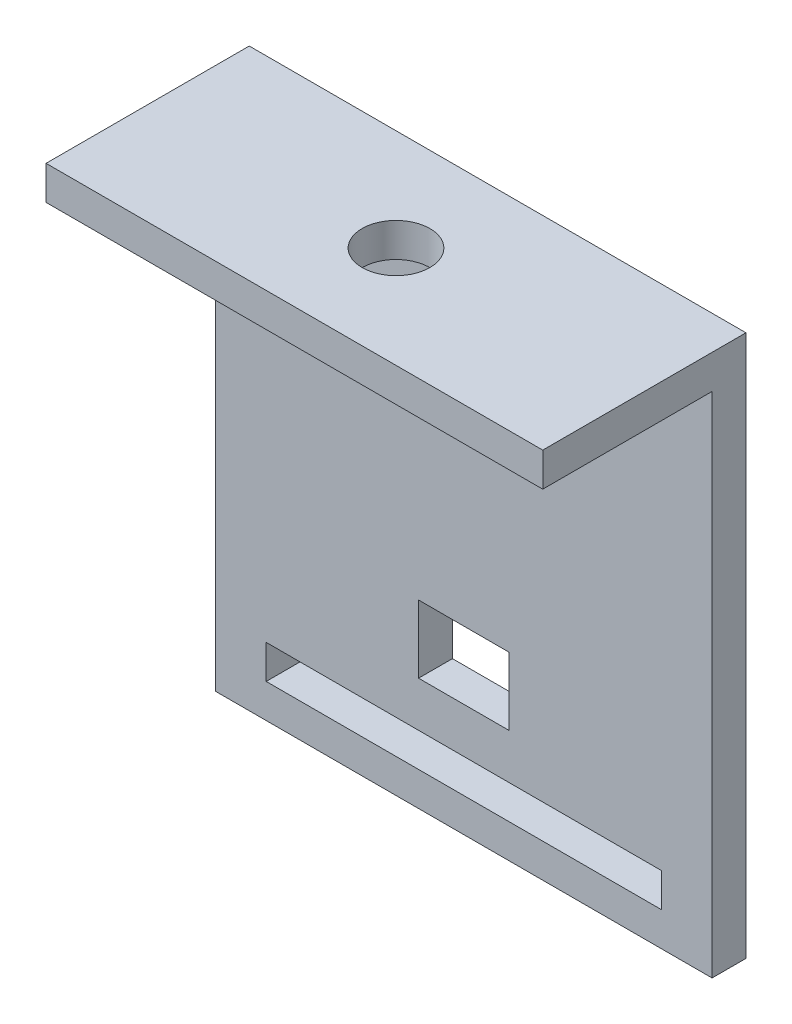
ISO-10303-21;
HEADER;
FILE_DESCRIPTION(('STEP AP214'),'2;1');
FILE_NAME('part.step','',(''),(''),'','','');
FILE_SCHEMA(('AUTOMOTIVE_DESIGN { 1 0 10303 214 1 1 1 1 }'));
ENDSEC;
DATA;
#1=APPLICATION_CONTEXT('core data for automotive mechanical design processes');
#2=APPLICATION_PROTOCOL_DEFINITION('international standard','automotive_design',2000,#1);
#3=PRODUCT_CONTEXT('',#1,'mechanical');
#4=PRODUCT('Part','Part','',(#3));
#5=PRODUCT_RELATED_PRODUCT_CATEGORY('part','',(#4));
#6=PRODUCT_DEFINITION_FORMATION('','',#4);
#7=PRODUCT_DEFINITION_CONTEXT('part definition',#1,'design');
#8=PRODUCT_DEFINITION('design','',#6,#7);
#9=PRODUCT_DEFINITION_SHAPE('','',#8);
#10=(LENGTH_UNIT() NAMED_UNIT(*) SI_UNIT(.MILLI.,.METRE.));
#11=(NAMED_UNIT(*) PLANE_ANGLE_UNIT() SI_UNIT($,.RADIAN.));
#12=(NAMED_UNIT(*) SI_UNIT($,.STERADIAN.) SOLID_ANGLE_UNIT());
#13=UNCERTAINTY_MEASURE_WITH_UNIT(LENGTH_MEASURE(1.E-05),#10,'distance_accuracy_value','');
#14=(GEOMETRIC_REPRESENTATION_CONTEXT(3) GLOBAL_UNCERTAINTY_ASSIGNED_CONTEXT((#13)) GLOBAL_UNIT_ASSIGNED_CONTEXT((#10,
#11,#12)) REPRESENTATION_CONTEXT('',''));
#15=CARTESIAN_POINT('',(0.,0.,0.));
#16=DIRECTION('',(0.,0.,1.));
#17=DIRECTION('',(1.,0.,0.));
#18=AXIS2_PLACEMENT_3D('',#15,#16,#17);
#19=CARTESIAN_POINT('',(44.,0.,-15.));
#20=DIRECTION('',(0.,1.,0.));
#21=DIRECTION('',(0.,0.,1.));
#22=AXIS2_PLACEMENT_3D('',#19,#20,#21);
#23=PLANE('',#22);
#24=CARTESIAN_POINT('',(22.,0.,-9.));
#25=DIRECTION('',(0.,1.,0.));
#26=DIRECTION('',(0.,0.,1.));
#27=AXIS2_PLACEMENT_3D('',#24,#25,#26);
#28=CIRCLE('',#27,3.);
#29=CARTESIAN_POINT('',(22.,0.,-6.));
#30=VERTEX_POINT('',#29);
#31=EDGE_CURVE('E173',#30,#30,#28,.T.);
#32=ORIENTED_EDGE('',*,*,#31,.T.);
#33=EDGE_LOOP('',(#32));
#34=FACE_BOUND('',#33,.T.);
#35=DIRECTION('',(0.,0.,-1.));
#36=VECTOR('',#35,1.);
#37=CARTESIAN_POINT('',(0.,0.,-15.));
#38=LINE('',#37,#36);
#39=CARTESIAN_POINT('',(0.,0.,0.));
#40=VERTEX_POINT('',#39);
#41=CARTESIAN_POINT('',(0.,0.,-15.));
#42=VERTEX_POINT('',#41);
#43=EDGE_CURVE('E190',#40,#42,#38,.T.);
#44=ORIENTED_EDGE('',*,*,#43,.T.);
#45=DIRECTION('',(-1.,0.,0.));
#46=VECTOR('',#45,1.);
#47=CARTESIAN_POINT('',(44.,0.,-15.));
#48=LINE('',#47,#46);
#49=CARTESIAN_POINT('',(44.,0.,-15.));
#50=VERTEX_POINT('',#49);
#51=EDGE_CURVE('E237',#50,#42,#48,.T.);
#52=ORIENTED_EDGE('',*,*,#51,.F.);
#53=DIRECTION('',(0.,0.,-1.));
#54=VECTOR('',#53,1.);
#55=CARTESIAN_POINT('',(44.,0.,-15.));
#56=LINE('',#55,#54);
#57=CARTESIAN_POINT('',(44.,0.,0.));
#58=VERTEX_POINT('',#57);
#59=EDGE_CURVE('E197',#58,#50,#56,.T.);
#60=ORIENTED_EDGE('',*,*,#59,.F.);
#61=DIRECTION('',(-1.,0.,0.));
#62=VECTOR('',#61,1.);
#63=CARTESIAN_POINT('',(44.,0.,0.));
#64=LINE('',#63,#62);
#65=EDGE_CURVE('E211',#58,#40,#64,.T.);
#66=ORIENTED_EDGE('',*,*,#65,.T.);
#67=EDGE_LOOP('',(#44,#52,#60,#66));
#68=FACE_BOUND('',#67,.T.);
#69=ADVANCED_FACE('F33',(#34,#68),#23,.F.);
#70=CARTESIAN_POINT('',(44.,-45.,-15.));
#71=DIRECTION('',(0.,0.,-1.));
#72=DIRECTION('',(0.,1.,0.));
#73=AXIS2_PLACEMENT_3D('',#70,#71,#72);
#74=PLANE('',#73);
#75=DIRECTION('',(-1.,0.,0.));
#76=VECTOR('',#75,1.);
#77=CARTESIAN_POINT('',(44.,-35.,-15.));
#78=LINE('',#77,#76);
#79=CARTESIAN_POINT('',(26.,-35.,-15.));
#80=VERTEX_POINT('',#79);
#81=CARTESIAN_POINT('',(18.,-35.,-15.));
#82=VERTEX_POINT('',#81);
#83=EDGE_CURVE('E164',#80,#82,#78,.T.);
#84=ORIENTED_EDGE('',*,*,#83,.T.);
#85=DIRECTION('',(0.,1.,0.));
#86=VECTOR('',#85,1.);
#87=CARTESIAN_POINT('',(18.,-45.,-15.));
#88=LINE('',#87,#86);
#89=CARTESIAN_POINT('',(18.,-29.,-15.));
#90=VERTEX_POINT('',#89);
#91=EDGE_CURVE('E167',#82,#90,#88,.T.);
#92=ORIENTED_EDGE('',*,*,#91,.T.);
#93=DIRECTION('',(1.,0.,0.));
#94=VECTOR('',#93,1.);
#95=CARTESIAN_POINT('',(44.,-29.,-15.));
#96=LINE('',#95,#94);
#97=CARTESIAN_POINT('',(26.,-29.,-15.));
#98=VERTEX_POINT('',#97);
#99=EDGE_CURVE('E159',#90,#98,#96,.T.);
#100=ORIENTED_EDGE('',*,*,#99,.T.);
#101=DIRECTION('',(0.,-1.,0.));
#102=VECTOR('',#101,1.);
#103=CARTESIAN_POINT('',(26.,-45.,-15.));
#104=LINE('',#103,#102);
#105=EDGE_CURVE('E139',#98,#80,#104,.T.);
#106=ORIENTED_EDGE('',*,*,#105,.T.);
#107=EDGE_LOOP('',(#84,#92,#100,#106));
#108=FACE_BOUND('',#107,.T.);
#109=DIRECTION('',(1.,0.,0.));
#110=VECTOR('',#109,1.);
#111=CARTESIAN_POINT('',(4.5,-42.,-15.));
#112=LINE('',#111,#110);
#113=CARTESIAN_POINT('',(4.5,-42.,-15.));
#114=VERTEX_POINT('',#113);
#115=CARTESIAN_POINT('',(39.5,-42.,-15.));
#116=VERTEX_POINT('',#115);
#117=EDGE_CURVE('E178',#114,#116,#112,.T.);
#118=ORIENTED_EDGE('',*,*,#117,.F.);
#119=DIRECTION('',(0.,-1.,0.));
#120=VECTOR('',#119,1.);
#121=CARTESIAN_POINT('',(4.5,-42.,-15.));
#122=LINE('',#121,#120);
#123=CARTESIAN_POINT('',(4.5,-39.,-15.));
#124=VERTEX_POINT('',#123);
#125=EDGE_CURVE('E176',#124,#114,#122,.T.);
#126=ORIENTED_EDGE('',*,*,#125,.F.);
#127=DIRECTION('',(-1.,0.,0.));
#128=VECTOR('',#127,1.);
#129=CARTESIAN_POINT('',(4.5,-39.,-15.));
#130=LINE('',#129,#128);
#131=CARTESIAN_POINT('',(39.5,-39.,-15.));
#132=VERTEX_POINT('',#131);
#133=EDGE_CURVE('E184',#132,#124,#130,.T.);
#134=ORIENTED_EDGE('',*,*,#133,.F.);
#135=DIRECTION('',(0.,1.,0.));
#136=VECTOR('',#135,1.);
#137=CARTESIAN_POINT('',(39.5,-42.,-15.));
#138=LINE('',#137,#136);
#139=EDGE_CURVE('E181',#116,#132,#138,.T.);
#140=ORIENTED_EDGE('',*,*,#139,.F.);
#141=EDGE_LOOP('',(#118,#126,#134,#140));
#142=FACE_BOUND('',#141,.T.);
#143=DIRECTION('',(0.,-1.,0.));
#144=VECTOR('',#143,1.);
#145=CARTESIAN_POINT('',(0.,-45.,-15.));
#146=LINE('',#145,#144);
#147=CARTESIAN_POINT('',(0.,-45.,-15.));
#148=VERTEX_POINT('',#147);
#149=EDGE_CURVE('E214',#42,#148,#146,.T.);
#150=ORIENTED_EDGE('',*,*,#149,.T.);
#151=DIRECTION('',(-1.,0.,0.));
#152=VECTOR('',#151,1.);
#153=CARTESIAN_POINT('',(44.,-45.,-15.));
#154=LINE('',#153,#152);
#155=CARTESIAN_POINT('',(44.,-45.,-15.));
#156=VERTEX_POINT('',#155);
#157=EDGE_CURVE('E234',#156,#148,#154,.T.);
#158=ORIENTED_EDGE('',*,*,#157,.F.);
#159=DIRECTION('',(0.,-1.,0.));
#160=VECTOR('',#159,1.);
#161=CARTESIAN_POINT('',(44.,-45.,-15.));
#162=LINE('',#161,#160);
#163=EDGE_CURVE('E200',#50,#156,#162,.T.);
#164=ORIENTED_EDGE('',*,*,#163,.F.);
#165=ORIENTED_EDGE('',*,*,#51,.T.);
#166=EDGE_LOOP('',(#150,#158,#164,#165));
#167=FACE_BOUND('',#166,.T.);
#168=ADVANCED_FACE('F259',(#108,#142,#167),#74,.F.);
#169=CARTESIAN_POINT('',(44.,-45.,-18.));
#170=DIRECTION('',(0.,1.,0.));
#171=DIRECTION('',(0.,0.,1.));
#172=AXIS2_PLACEMENT_3D('',#169,#170,#171);
#173=PLANE('',#172);
#174=DIRECTION('',(0.,0.,-1.));
#175=VECTOR('',#174,1.);
#176=CARTESIAN_POINT('',(0.,-45.,-18.));
#177=LINE('',#176,#175);
#178=CARTESIAN_POINT('',(0.,-45.,-18.));
#179=VERTEX_POINT('',#178);
#180=EDGE_CURVE('E216',#148,#179,#177,.T.);
#181=ORIENTED_EDGE('',*,*,#180,.T.);
#182=DIRECTION('',(-1.,0.,0.));
#183=VECTOR('',#182,1.);
#184=CARTESIAN_POINT('',(44.,-45.,-18.));
#185=LINE('',#184,#183);
#186=CARTESIAN_POINT('',(44.,-45.,-18.));
#187=VERTEX_POINT('',#186);
#188=EDGE_CURVE('E231',#187,#179,#185,.T.);
#189=ORIENTED_EDGE('',*,*,#188,.F.);
#190=DIRECTION('',(0.,0.,-1.));
#191=VECTOR('',#190,1.);
#192=CARTESIAN_POINT('',(44.,-45.,-18.));
#193=LINE('',#192,#191);
#194=EDGE_CURVE('E203',#156,#187,#193,.T.);
#195=ORIENTED_EDGE('',*,*,#194,.F.);
#196=ORIENTED_EDGE('',*,*,#157,.T.);
#197=EDGE_LOOP('',(#181,#189,#195,#196));
#198=FACE_BOUND('',#197,.T.);
#199=ADVANCED_FACE('F283',(#198),#173,.F.);
#200=CARTESIAN_POINT('',(44.,3.,-18.));
#201=DIRECTION('',(0.,0.,1.));
#202=DIRECTION('',(0.,-1.,0.));
#203=AXIS2_PLACEMENT_3D('',#200,#201,#202);
#204=PLANE('',#203);
#205=DIRECTION('',(1.,0.,0.));
#206=VECTOR('',#205,1.);
#207=CARTESIAN_POINT('',(26.,-29.,-18.));
#208=LINE('',#207,#206);
#209=CARTESIAN_POINT('',(18.,-29.,-18.));
#210=VERTEX_POINT('',#209);
#211=CARTESIAN_POINT('',(26.,-29.,-18.));
#212=VERTEX_POINT('',#211);
#213=EDGE_CURVE('E145',#210,#212,#208,.T.);
#214=ORIENTED_EDGE('',*,*,#213,.F.);
#215=DIRECTION('',(0.,1.,0.));
#216=VECTOR('',#215,1.);
#217=CARTESIAN_POINT('',(18.,-29.,-18.));
#218=LINE('',#217,#216);
#219=CARTESIAN_POINT('',(18.,-35.,-18.));
#220=VERTEX_POINT('',#219);
#221=EDGE_CURVE('E55',#220,#210,#218,.T.);
#222=ORIENTED_EDGE('',*,*,#221,.F.);
#223=DIRECTION('',(-1.,0.,0.));
#224=VECTOR('',#223,1.);
#225=CARTESIAN_POINT('',(26.,-35.,-18.));
#226=LINE('',#225,#224);
#227=CARTESIAN_POINT('',(26.,-35.,-18.));
#228=VERTEX_POINT('',#227);
#229=EDGE_CURVE('E152',#228,#220,#226,.T.);
#230=ORIENTED_EDGE('',*,*,#229,.F.);
#231=DIRECTION('',(0.,-1.,0.));
#232=VECTOR('',#231,1.);
#233=CARTESIAN_POINT('',(26.,-35.,-18.));
#234=LINE('',#233,#232);
#235=EDGE_CURVE('E136',#212,#228,#234,.T.);
#236=ORIENTED_EDGE('',*,*,#235,.F.);
#237=EDGE_LOOP('',(#214,#222,#230,#236));
#238=FACE_BOUND('',#237,.T.);
#239=DIRECTION('',(-1.,0.,0.));
#240=VECTOR('',#239,1.);
#241=CARTESIAN_POINT('',(44.,-39.,-18.));
#242=LINE('',#241,#240);
#243=CARTESIAN_POINT('',(39.5,-39.,-18.));
#244=VERTEX_POINT('',#243);
#245=CARTESIAN_POINT('',(4.5,-39.,-18.));
#246=VERTEX_POINT('',#245);
#247=EDGE_CURVE('E40',#244,#246,#242,.T.);
#248=ORIENTED_EDGE('',*,*,#247,.T.);
#249=DIRECTION('',(0.,-1.,0.));
#250=VECTOR('',#249,1.);
#251=CARTESIAN_POINT('',(4.5,3.,-18.));
#252=LINE('',#251,#250);
#253=CARTESIAN_POINT('',(4.5,-42.,-18.));
#254=VERTEX_POINT('',#253);
#255=EDGE_CURVE('E11',#246,#254,#252,.T.);
#256=ORIENTED_EDGE('',*,*,#255,.T.);
#257=DIRECTION('',(1.,0.,0.));
#258=VECTOR('',#257,1.);
#259=CARTESIAN_POINT('',(44.,-42.,-18.));
#260=LINE('',#259,#258);
#261=CARTESIAN_POINT('',(39.5,-42.,-18.));
#262=VERTEX_POINT('',#261);
#263=EDGE_CURVE('E240',#254,#262,#260,.T.);
#264=ORIENTED_EDGE('',*,*,#263,.T.);
#265=DIRECTION('',(0.,1.,0.));
#266=VECTOR('',#265,1.);
#267=CARTESIAN_POINT('',(39.5,3.,-18.));
#268=LINE('',#267,#266);
#269=EDGE_CURVE('E243',#262,#244,#268,.T.);
#270=ORIENTED_EDGE('',*,*,#269,.T.);
#271=EDGE_LOOP('',(#248,#256,#264,#270));
#272=FACE_BOUND('',#271,.T.);
#273=DIRECTION('',(0.,1.,0.));
#274=VECTOR('',#273,1.);
#275=CARTESIAN_POINT('',(0.,3.,-18.));
#276=LINE('',#275,#274);
#277=CARTESIAN_POINT('',(0.,3.,-18.));
#278=VERTEX_POINT('',#277);
#279=EDGE_CURVE('E218',#179,#278,#276,.T.);
#280=ORIENTED_EDGE('',*,*,#279,.T.);
#281=DIRECTION('',(-1.,0.,0.));
#282=VECTOR('',#281,1.);
#283=CARTESIAN_POINT('',(44.,3.,-18.));
#284=LINE('',#283,#282);
#285=CARTESIAN_POINT('',(44.,3.,-18.));
#286=VERTEX_POINT('',#285);
#287=EDGE_CURVE('E228',#286,#278,#284,.T.);
#288=ORIENTED_EDGE('',*,*,#287,.F.);
#289=DIRECTION('',(0.,1.,0.));
#290=VECTOR('',#289,1.);
#291=CARTESIAN_POINT('',(44.,3.,-18.));
#292=LINE('',#291,#290);
#293=EDGE_CURVE('E205',#187,#286,#292,.T.);
#294=ORIENTED_EDGE('',*,*,#293,.F.);
#295=ORIENTED_EDGE('',*,*,#188,.T.);
#296=EDGE_LOOP('',(#280,#288,#294,#295));
#297=FACE_BOUND('',#296,.T.);
#298=ADVANCED_FACE('F149',(#238,#272,#297),#204,.F.);
#299=CARTESIAN_POINT('',(44.,3.,0.));
#300=DIRECTION('',(0.,-1.,0.));
#301=DIRECTION('',(0.,0.,-1.));
#302=AXIS2_PLACEMENT_3D('',#299,#300,#301);
#303=PLANE('',#302);
#304=CARTESIAN_POINT('',(22.,3.,-9.));
#305=DIRECTION('',(0.,1.,0.));
#306=DIRECTION('',(0.,0.,1.));
#307=AXIS2_PLACEMENT_3D('',#304,#305,#306);
#308=CIRCLE('',#307,3.);
#309=CARTESIAN_POINT('',(22.,3.,-6.));
#310=VERTEX_POINT('',#309);
#311=EDGE_CURVE('E170',#310,#310,#308,.T.);
#312=ORIENTED_EDGE('',*,*,#311,.F.);
#313=EDGE_LOOP('',(#312));
#314=FACE_BOUND('',#313,.T.);
#315=DIRECTION('',(0.,0.,1.));
#316=VECTOR('',#315,1.);
#317=CARTESIAN_POINT('',(0.,3.,0.));
#318=LINE('',#317,#316);
#319=CARTESIAN_POINT('',(0.,3.,0.));
#320=VERTEX_POINT('',#319);
#321=EDGE_CURVE('E220',#278,#320,#318,.T.);
#322=ORIENTED_EDGE('',*,*,#321,.T.);
#323=DIRECTION('',(-1.,0.,0.));
#324=VECTOR('',#323,1.);
#325=CARTESIAN_POINT('',(44.,3.,0.));
#326=LINE('',#325,#324);
#327=CARTESIAN_POINT('',(44.,3.,0.));
#328=VERTEX_POINT('',#327);
#329=EDGE_CURVE('E225',#328,#320,#326,.T.);
#330=ORIENTED_EDGE('',*,*,#329,.F.);
#331=DIRECTION('',(0.,0.,1.));
#332=VECTOR('',#331,1.);
#333=CARTESIAN_POINT('',(44.,3.,0.));
#334=LINE('',#333,#332);
#335=EDGE_CURVE('E207',#286,#328,#334,.T.);
#336=ORIENTED_EDGE('',*,*,#335,.F.);
#337=ORIENTED_EDGE('',*,*,#287,.T.);
#338=EDGE_LOOP('',(#322,#330,#336,#337));
#339=FACE_BOUND('',#338,.T.);
#340=ADVANCED_FACE('F307',(#314,#339),#303,.F.);
#341=CARTESIAN_POINT('',(44.,0.,0.));
#342=DIRECTION('',(0.,0.,-1.));
#343=DIRECTION('',(-1.,0.,0.));
#344=AXIS2_PLACEMENT_3D('',#341,#342,#343);
#345=PLANE('',#344);
#346=DIRECTION('',(0.,-1.,0.));
#347=VECTOR('',#346,1.);
#348=CARTESIAN_POINT('',(0.,0.,0.));
#349=LINE('',#348,#347);
#350=EDGE_CURVE('E201',#320,#40,#349,.T.);
#351=ORIENTED_EDGE('',*,*,#350,.T.);
#352=ORIENTED_EDGE('',*,*,#65,.F.);
#353=DIRECTION('',(0.,-1.,0.));
#354=VECTOR('',#353,1.);
#355=CARTESIAN_POINT('',(44.,0.,0.));
#356=LINE('',#355,#354);
#357=EDGE_CURVE('E209',#328,#58,#356,.T.);
#358=ORIENTED_EDGE('',*,*,#357,.F.);
#359=ORIENTED_EDGE('',*,*,#329,.T.);
#360=EDGE_LOOP('',(#351,#352,#358,#359));
#361=FACE_BOUND('',#360,.T.);
#362=ADVANCED_FACE('F305',(#361),#345,.F.);
#363=CARTESIAN_POINT('',(44.,0.,0.));
#364=DIRECTION('',(-1.,0.,0.));
#365=DIRECTION('',(0.,0.,1.));
#366=AXIS2_PLACEMENT_3D('',#363,#364,#365);
#367=PLANE('',#366);
#368=ORIENTED_EDGE('',*,*,#59,.T.);
#369=ORIENTED_EDGE('',*,*,#163,.T.);
#370=ORIENTED_EDGE('',*,*,#194,.T.);
#371=ORIENTED_EDGE('',*,*,#293,.T.);
#372=ORIENTED_EDGE('',*,*,#335,.T.);
#373=ORIENTED_EDGE('',*,*,#357,.T.);
#374=EDGE_LOOP('',(#368,#369,#370,#371,#372,#373));
#375=FACE_BOUND('',#374,.T.);
#376=ADVANCED_FACE('F300',(#375),#367,.F.);
#377=CARTESIAN_POINT('',(0.,0.,0.));
#378=DIRECTION('',(-1.,0.,0.));
#379=DIRECTION('',(0.,0.,1.));
#380=AXIS2_PLACEMENT_3D('',#377,#378,#379);
#381=PLANE('',#380);
#382=ORIENTED_EDGE('',*,*,#43,.F.);
#383=ORIENTED_EDGE('',*,*,#350,.F.);
#384=ORIENTED_EDGE('',*,*,#321,.F.);
#385=ORIENTED_EDGE('',*,*,#279,.F.);
#386=ORIENTED_EDGE('',*,*,#180,.F.);
#387=ORIENTED_EDGE('',*,*,#149,.F.);
#388=EDGE_LOOP('',(#382,#383,#384,#385,#386,#387));
#389=FACE_BOUND('',#388,.T.);
#390=ADVANCED_FACE('F293',(#389),#381,.T.);
#391=CARTESIAN_POINT('',(4.5,-42.,-59.));
#392=DIRECTION('',(-1.,0.,0.));
#393=DIRECTION('',(0.,0.,1.));
#394=AXIS2_PLACEMENT_3D('',#391,#392,#393);
#395=PLANE('',#394);
#396=DIRECTION('',(0.,0.,1.));
#397=VECTOR('',#396,1.);
#398=CARTESIAN_POINT('',(4.5,-39.,-59.));
#399=LINE('',#398,#397);
#400=EDGE_CURVE('E188',#246,#124,#399,.T.);
#401=ORIENTED_EDGE('',*,*,#400,.T.);
#402=ORIENTED_EDGE('',*,*,#125,.T.);
#403=DIRECTION('',(0.,0.,1.));
#404=VECTOR('',#403,1.);
#405=CARTESIAN_POINT('',(4.5,-42.,-59.));
#406=LINE('',#405,#404);
#407=EDGE_CURVE('E187',#254,#114,#406,.T.);
#408=ORIENTED_EDGE('',*,*,#407,.F.);
#409=ORIENTED_EDGE('',*,*,#255,.F.);
#410=EDGE_LOOP('',(#401,#402,#408,#409));
#411=FACE_BOUND('',#410,.T.);
#412=ADVANCED_FACE('F263',(#411),#395,.F.);
#413=CARTESIAN_POINT('',(4.5,-39.,-59.));
#414=DIRECTION('',(0.,1.,0.));
#415=DIRECTION('',(0.,0.,1.));
#416=AXIS2_PLACEMENT_3D('',#413,#414,#415);
#417=PLANE('',#416);
#418=DIRECTION('',(0.,0.,1.));
#419=VECTOR('',#418,1.);
#420=CARTESIAN_POINT('',(39.5,-39.,-59.));
#421=LINE('',#420,#419);
#422=EDGE_CURVE('E191',#244,#132,#421,.T.);
#423=ORIENTED_EDGE('',*,*,#422,.T.);
#424=ORIENTED_EDGE('',*,*,#133,.T.);
#425=ORIENTED_EDGE('',*,*,#400,.F.);
#426=ORIENTED_EDGE('',*,*,#247,.F.);
#427=EDGE_LOOP('',(#423,#424,#425,#426));
#428=FACE_BOUND('',#427,.T.);
#429=ADVANCED_FACE('F251',(#428),#417,.F.);
#430=CARTESIAN_POINT('',(39.5,-42.,-59.));
#431=DIRECTION('',(1.,0.,0.));
#432=DIRECTION('',(0.,0.,-1.));
#433=AXIS2_PLACEMENT_3D('',#430,#431,#432);
#434=PLANE('',#433);
#435=DIRECTION('',(0.,0.,1.));
#436=VECTOR('',#435,1.);
#437=CARTESIAN_POINT('',(39.5,-42.,-59.));
#438=LINE('',#437,#436);
#439=EDGE_CURVE('E193',#262,#116,#438,.T.);
#440=ORIENTED_EDGE('',*,*,#439,.T.);
#441=ORIENTED_EDGE('',*,*,#139,.T.);
#442=ORIENTED_EDGE('',*,*,#422,.F.);
#443=ORIENTED_EDGE('',*,*,#269,.F.);
#444=EDGE_LOOP('',(#440,#441,#442,#443));
#445=FACE_BOUND('',#444,.T.);
#446=ADVANCED_FACE('F253',(#445),#434,.F.);
#447=CARTESIAN_POINT('',(4.5,-42.,-59.));
#448=DIRECTION('',(0.,-1.,0.));
#449=DIRECTION('',(0.,0.,-1.));
#450=AXIS2_PLACEMENT_3D('',#447,#448,#449);
#451=PLANE('',#450);
#452=ORIENTED_EDGE('',*,*,#407,.T.);
#453=ORIENTED_EDGE('',*,*,#117,.T.);
#454=ORIENTED_EDGE('',*,*,#439,.F.);
#455=ORIENTED_EDGE('',*,*,#263,.F.);
#456=EDGE_LOOP('',(#452,#453,#454,#455));
#457=FACE_BOUND('',#456,.T.);
#458=ADVANCED_FACE('F265',(#457),#451,.F.);
#459=CARTESIAN_POINT('',(22.,-7.,-9.));
#460=DIRECTION('',(0.,1.,0.));
#461=DIRECTION('',(0.,0.,1.));
#462=AXIS2_PLACEMENT_3D('',#459,#460,#461);
#463=CYLINDRICAL_SURFACE('',#462,3.);
#464=ORIENTED_EDGE('',*,*,#311,.T.);
#465=EDGE_LOOP('',(#464));
#466=FACE_BOUND('',#465,.T.);
#467=ORIENTED_EDGE('',*,*,#31,.F.);
#468=EDGE_LOOP('',(#467));
#469=FACE_BOUND('',#468,.T.);
#470=ADVANCED_FACE('F267',(#466,#469),#463,.F.);
#471=CARTESIAN_POINT('',(18.,-29.,-8.));
#472=DIRECTION('',(-1.,0.,0.));
#473=DIRECTION('',(0.,0.,1.));
#474=AXIS2_PLACEMENT_3D('',#471,#472,#473);
#475=PLANE('',#474);
#476=DIRECTION('',(0.,0.,-1.));
#477=VECTOR('',#476,1.);
#478=CARTESIAN_POINT('',(18.,-35.,-8.));
#479=LINE('',#478,#477);
#480=EDGE_CURVE('E157',#82,#220,#479,.T.);
#481=ORIENTED_EDGE('',*,*,#480,.T.);
#482=ORIENTED_EDGE('',*,*,#221,.T.);
#483=DIRECTION('',(0.,0.,-1.));
#484=VECTOR('',#483,1.);
#485=CARTESIAN_POINT('',(18.,-29.,-8.));
#486=LINE('',#485,#484);
#487=EDGE_CURVE('E142',#90,#210,#486,.T.);
#488=ORIENTED_EDGE('',*,*,#487,.F.);
#489=ORIENTED_EDGE('',*,*,#91,.F.);
#490=EDGE_LOOP('',(#481,#482,#488,#489));
#491=FACE_BOUND('',#490,.T.);
#492=ADVANCED_FACE('F273',(#491),#475,.F.);
#493=CARTESIAN_POINT('',(26.,-35.,-8.));
#494=DIRECTION('',(0.,-1.,0.));
#495=DIRECTION('',(0.,0.,-1.));
#496=AXIS2_PLACEMENT_3D('',#493,#494,#495);
#497=PLANE('',#496);
#498=DIRECTION('',(0.,0.,-1.));
#499=VECTOR('',#498,1.);
#500=CARTESIAN_POINT('',(26.,-35.,-8.));
#501=LINE('',#500,#499);
#502=EDGE_CURVE('E141',#80,#228,#501,.T.);
#503=ORIENTED_EDGE('',*,*,#502,.T.);
#504=ORIENTED_EDGE('',*,*,#229,.T.);
#505=ORIENTED_EDGE('',*,*,#480,.F.);
#506=ORIENTED_EDGE('',*,*,#83,.F.);
#507=EDGE_LOOP('',(#503,#504,#505,#506));
#508=FACE_BOUND('',#507,.T.);
#509=ADVANCED_FACE('F337',(#508),#497,.F.);
#510=CARTESIAN_POINT('',(26.,-35.,-8.));
#511=DIRECTION('',(1.,0.,0.));
#512=DIRECTION('',(0.,1.,0.));
#513=AXIS2_PLACEMENT_3D('',#510,#511,#512);
#514=PLANE('',#513);
#515=DIRECTION('',(0.,0.,-1.));
#516=VECTOR('',#515,1.);
#517=CARTESIAN_POINT('',(26.,-29.,-8.));
#518=LINE('',#517,#516);
#519=EDGE_CURVE('E47',#98,#212,#518,.T.);
#520=ORIENTED_EDGE('',*,*,#519,.T.);
#521=ORIENTED_EDGE('',*,*,#235,.T.);
#522=ORIENTED_EDGE('',*,*,#502,.F.);
#523=ORIENTED_EDGE('',*,*,#105,.F.);
#524=EDGE_LOOP('',(#520,#521,#522,#523));
#525=FACE_BOUND('',#524,.T.);
#526=ADVANCED_FACE('F133',(#525),#514,.F.);
#527=CARTESIAN_POINT('',(26.,-29.,-8.));
#528=DIRECTION('',(0.,1.,0.));
#529=DIRECTION('',(0.,0.,1.));
#530=AXIS2_PLACEMENT_3D('',#527,#528,#529);
#531=PLANE('',#530);
#532=ORIENTED_EDGE('',*,*,#487,.T.);
#533=ORIENTED_EDGE('',*,*,#213,.T.);
#534=ORIENTED_EDGE('',*,*,#519,.F.);
#535=ORIENTED_EDGE('',*,*,#99,.F.);
#536=EDGE_LOOP('',(#532,#533,#534,#535));
#537=FACE_BOUND('',#536,.T.);
#538=ADVANCED_FACE('F146',(#537),#531,.F.);
#539=CLOSED_SHELL('',(#69,#168,#199,#298,#340,#362,#376,#390,#412,#429,#446,#458,#470,#492,#509,
#526,#538));
#540=MANIFOLD_SOLID_BREP('B2',#539);
#541=ADVANCED_BREP_SHAPE_REPRESENTATION('',(#18,#540),#14);
#542=SHAPE_DEFINITION_REPRESENTATION(#9,#541);
ENDSEC;
END-ISO-10303-21;
